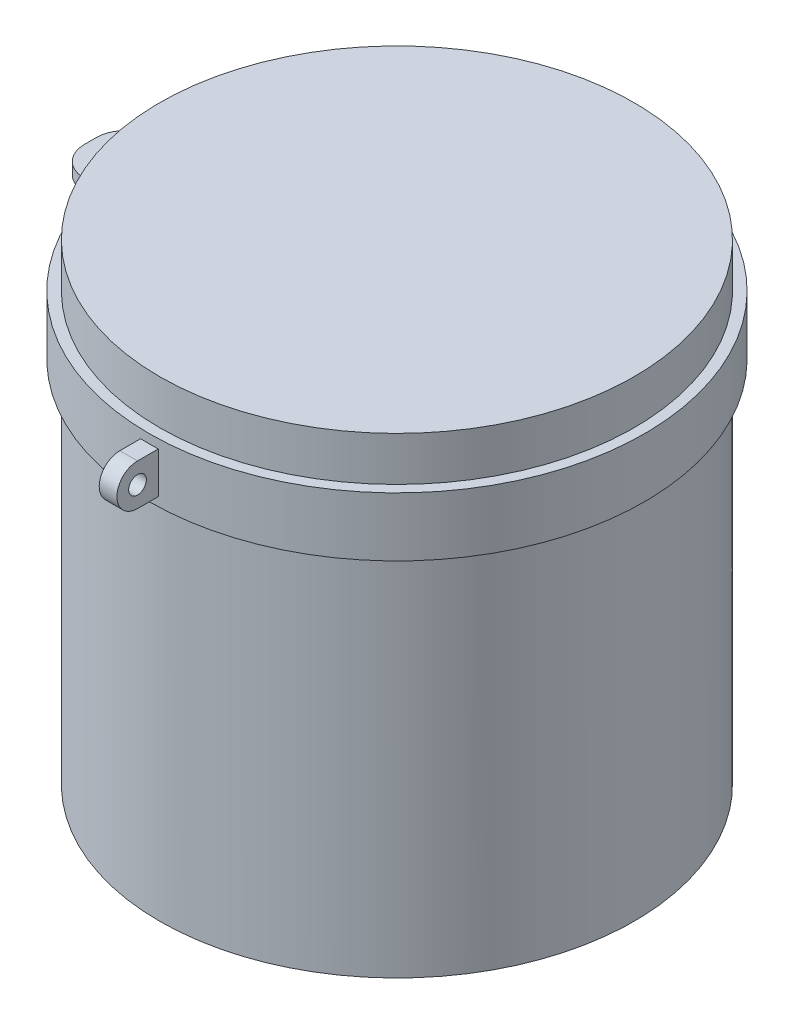
ISO-10303-21;
HEADER;
FILE_DESCRIPTION(('STEP AP214'),'2;1');
FILE_NAME('part.step','',(''),(''),'','','');
FILE_SCHEMA(('AUTOMOTIVE_DESIGN { 1 0 10303 214 1 1 1 1 }'));
ENDSEC;
DATA;
#1=APPLICATION_CONTEXT('core data for automotive mechanical design processes');
#2=APPLICATION_PROTOCOL_DEFINITION('international standard','automotive_design',2000,#1);
#3=PRODUCT_CONTEXT('',#1,'mechanical');
#4=PRODUCT('Part','Part','',(#3));
#5=PRODUCT_RELATED_PRODUCT_CATEGORY('part','',(#4));
#6=PRODUCT_DEFINITION_FORMATION('','',#4);
#7=PRODUCT_DEFINITION_CONTEXT('part definition',#1,'design');
#8=PRODUCT_DEFINITION('design','',#6,#7);
#9=PRODUCT_DEFINITION_SHAPE('','',#8);
#10=(LENGTH_UNIT() NAMED_UNIT(*) SI_UNIT(.MILLI.,.METRE.));
#11=(NAMED_UNIT(*) PLANE_ANGLE_UNIT() SI_UNIT($,.RADIAN.));
#12=(NAMED_UNIT(*) SI_UNIT($,.STERADIAN.) SOLID_ANGLE_UNIT());
#13=UNCERTAINTY_MEASURE_WITH_UNIT(LENGTH_MEASURE(1.E-05),#10,'distance_accuracy_value','');
#14=(GEOMETRIC_REPRESENTATION_CONTEXT(3) GLOBAL_UNCERTAINTY_ASSIGNED_CONTEXT((#13)) GLOBAL_UNIT_ASSIGNED_CONTEXT((#10,
#11,#12)) REPRESENTATION_CONTEXT('',''));
#15=CARTESIAN_POINT('',(0.,0.,0.));
#16=DIRECTION('',(0.,0.,1.));
#17=DIRECTION('',(1.,0.,0.));
#18=AXIS2_PLACEMENT_3D('',#15,#16,#17);
#19=CARTESIAN_POINT('',(0.,1662.87303259067,0.));
#20=DIRECTION('',(0.,1.,0.));
#21=DIRECTION('',(0.,0.,1.));
#22=AXIS2_PLACEMENT_3D('',#19,#20,#21);
#23=CYLINDRICAL_SURFACE('',#22,840.);
#24=CARTESIAN_POINT('',(0.,1250.,0.));
#25=DIRECTION('',(0.,1.,0.));
#26=DIRECTION('',(0.,0.,1.));
#27=AXIS2_PLACEMENT_3D('',#24,#25,#26);
#28=CIRCLE('',#27,840.);
#29=CARTESIAN_POINT('',(0.,1250.,840.));
#30=VERTEX_POINT('',#29);
#31=EDGE_CURVE('E307',#30,#30,#28,.T.);
#32=ORIENTED_EDGE('',*,*,#31,.T.);
#33=EDGE_LOOP('',(#32));
#34=FACE_BOUND('',#33,.T.);
#35=CARTESIAN_POINT('',(0.,1450.,0.));
#36=DIRECTION('',(0.,1.,0.));
#37=DIRECTION('',(0.,0.,1.));
#38=AXIS2_PLACEMENT_3D('',#35,#36,#37);
#39=CIRCLE('',#38,840.);
#40=CARTESIAN_POINT('',(0.,1450.,840.));
#41=VERTEX_POINT('',#40);
#42=EDGE_CURVE('E304',#41,#41,#39,.T.);
#43=ORIENTED_EDGE('',*,*,#42,.F.);
#44=EDGE_LOOP('',(#43));
#45=FACE_BOUND('',#44,.T.);
#46=DIRECTION('',(0.,1.,0.));
#47=VECTOR('',#46,1.);
#48=CARTESIAN_POINT('',(-30.,1662.87303259067,839.464114777993));
#49=LINE('',#48,#47);
#50=CARTESIAN_POINT('',(-30.,1280.,839.464114777993));
#51=VERTEX_POINT('',#50);
#52=CARTESIAN_POINT('',(-30.,1420.,839.464114777993));
#53=VERTEX_POINT('',#52);
#54=EDGE_CURVE('E313',#51,#53,#49,.T.);
#55=ORIENTED_EDGE('',*,*,#54,.T.);
#56=CARTESIAN_POINT('',(0.,1420.,0.));
#57=DIRECTION('',(0.,-1.,0.));
#58=DIRECTION('',(0.,0.,-1.));
#59=AXIS2_PLACEMENT_3D('',#56,#57,#58);
#60=CIRCLE('',#59,840.);
#61=CARTESIAN_POINT('',(30.,1420.,839.464114777993));
#62=VERTEX_POINT('',#61);
#63=EDGE_CURVE('E317',#53,#62,#60,.F.);
#64=ORIENTED_EDGE('',*,*,#63,.T.);
#65=DIRECTION('',(0.,1.,0.));
#66=VECTOR('',#65,1.);
#67=CARTESIAN_POINT('',(30.,1662.87303259067,839.464114777993));
#68=LINE('',#67,#66);
#69=CARTESIAN_POINT('',(30.,1280.,839.464114777993));
#70=VERTEX_POINT('',#69);
#71=EDGE_CURVE('E316',#70,#62,#68,.T.);
#72=ORIENTED_EDGE('',*,*,#71,.F.);
#73=CARTESIAN_POINT('',(0.,1280.,0.));
#74=DIRECTION('',(0.,1.,0.));
#75=DIRECTION('',(0.,0.,1.));
#76=AXIS2_PLACEMENT_3D('',#73,#74,#75);
#77=CIRCLE('',#76,840.);
#78=EDGE_CURVE('E310',#70,#51,#77,.F.);
#79=ORIENTED_EDGE('',*,*,#78,.T.);
#80=EDGE_LOOP('',(#55,#64,#72,#79));
#81=FACE_BOUND('',#80,.T.);
#82=CARTESIAN_POINT('',(0.,1330.,0.));
#83=DIRECTION('',(0.,-1.,0.));
#84=DIRECTION('',(0.,0.,1.));
#85=AXIS2_PLACEMENT_3D('',#82,#83,#84);
#86=CIRCLE('',#85,840.);
#87=CARTESIAN_POINT('',(-831.384387633061,1330.,120.));
#88=VERTEX_POINT('',#87);
#89=CARTESIAN_POINT('',(-831.384387633061,1330.,-120.));
#90=VERTEX_POINT('',#89);
#91=EDGE_CURVE('E55',#88,#90,#86,.T.);
#92=ORIENTED_EDGE('',*,*,#91,.T.);
#93=DIRECTION('',(0.,-1.,0.));
#94=VECTOR('',#93,1.);
#95=CARTESIAN_POINT('',(-831.384387633061,1370.,-120.));
#96=LINE('',#95,#94);
#97=CARTESIAN_POINT('',(-831.384387633061,1370.,-120.));
#98=VERTEX_POINT('',#97);
#99=EDGE_CURVE('E278',#98,#90,#96,.T.);
#100=ORIENTED_EDGE('',*,*,#99,.F.);
#101=CARTESIAN_POINT('',(0.,1370.,0.));
#102=DIRECTION('',(0.,-1.,0.));
#103=DIRECTION('',(0.,0.,1.));
#104=AXIS2_PLACEMENT_3D('',#101,#102,#103);
#105=CIRCLE('',#104,840.);
#106=CARTESIAN_POINT('',(-831.384387633061,1370.,120.));
#107=VERTEX_POINT('',#106);
#108=EDGE_CURVE('E239',#107,#98,#105,.T.);
#109=ORIENTED_EDGE('',*,*,#108,.F.);
#110=DIRECTION('',(0.,-1.,0.));
#111=VECTOR('',#110,1.);
#112=CARTESIAN_POINT('',(-831.384387633061,1370.,120.));
#113=LINE('',#112,#111);
#114=EDGE_CURVE('E253',#107,#88,#113,.T.);
#115=ORIENTED_EDGE('',*,*,#114,.T.);
#116=EDGE_LOOP('',(#92,#100,#109,#115));
#117=FACE_BOUND('',#116,.T.);
#118=ADVANCED_FACE('F39',(#34,#45,#81,#117),#23,.T.);
#119=CARTESIAN_POINT('',(-800.,1250.,0.));
#120=DIRECTION('',(0.,-1.,0.));
#121=DIRECTION('',(0.,0.,-1.));
#122=AXIS2_PLACEMENT_3D('',#119,#120,#121);
#123=PLANE('',#122);
#124=CARTESIAN_POINT('',(0.,1250.,0.));
#125=DIRECTION('',(0.,-1.,0.));
#126=DIRECTION('',(0.,0.,-1.));
#127=AXIS2_PLACEMENT_3D('',#124,#125,#126);
#128=CIRCLE('',#127,805.);
#129=CARTESIAN_POINT('',(0.,1250.,-805.));
#130=VERTEX_POINT('',#129);
#131=EDGE_CURVE('E12',#130,#130,#128,.T.);
#132=ORIENTED_EDGE('',*,*,#131,.F.);
#133=EDGE_LOOP('',(#132));
#134=FACE_BOUND('',#133,.T.);
#135=ORIENTED_EDGE('',*,*,#31,.F.);
#136=EDGE_LOOP('',(#135));
#137=FACE_BOUND('',#136,.T.);
#138=ADVANCED_FACE('F41',(#134,#137),#123,.T.);
#139=CARTESIAN_POINT('',(-800.,1450.,0.));
#140=DIRECTION('',(0.,1.,0.));
#141=DIRECTION('',(0.,0.,1.));
#142=AXIS2_PLACEMENT_3D('',#139,#140,#141);
#143=PLANE('',#142);
#144=CARTESIAN_POINT('',(0.,1450.,0.));
#145=DIRECTION('',(0.,1.,0.));
#146=DIRECTION('',(0.,0.,1.));
#147=AXIS2_PLACEMENT_3D('',#144,#145,#146);
#148=CIRCLE('',#147,805.);
#149=CARTESIAN_POINT('',(0.,1450.,805.));
#150=VERTEX_POINT('',#149);
#151=EDGE_CURVE('E43',#150,#150,#148,.T.);
#152=ORIENTED_EDGE('',*,*,#151,.F.);
#153=EDGE_LOOP('',(#152));
#154=FACE_BOUND('',#153,.T.);
#155=ORIENTED_EDGE('',*,*,#42,.T.);
#156=EDGE_LOOP('',(#155));
#157=FACE_BOUND('',#156,.T.);
#158=ADVANCED_FACE('F327',(#154,#157),#143,.T.);
#159=CARTESIAN_POINT('',(30.,1350.,910.));
#160=DIRECTION('',(1.,0.,0.));
#161=DIRECTION('',(0.,0.,-1.));
#162=AXIS2_PLACEMENT_3D('',#159,#160,#161);
#163=PLANE('',#162);
#164=DIRECTION('',(0.,0.,-1.));
#165=VECTOR('',#164,1.);
#166=CARTESIAN_POINT('',(30.,1280.,800.));
#167=LINE('',#166,#165);
#168=CARTESIAN_POINT('',(30.,1280.,910.));
#169=VERTEX_POINT('',#168);
#170=EDGE_CURVE('E292',#169,#70,#167,.T.);
#171=ORIENTED_EDGE('',*,*,#170,.T.);
#172=ORIENTED_EDGE('',*,*,#71,.T.);
#173=DIRECTION('',(0.,0.,1.));
#174=VECTOR('',#173,1.);
#175=CARTESIAN_POINT('',(30.,1420.,910.));
#176=LINE('',#175,#174);
#177=CARTESIAN_POINT('',(30.,1420.,910.));
#178=VERTEX_POINT('',#177);
#179=EDGE_CURVE('E288',#62,#178,#176,.T.);
#180=ORIENTED_EDGE('',*,*,#179,.T.);
#181=CARTESIAN_POINT('',(30.,1350.,910.));
#182=DIRECTION('',(1.,0.,0.));
#183=DIRECTION('',(0.,0.,-1.));
#184=AXIS2_PLACEMENT_3D('',#181,#182,#183);
#185=CIRCLE('',#184,70.0000000000001);
#186=EDGE_CURVE('E290',#178,#169,#185,.T.);
#187=ORIENTED_EDGE('',*,*,#186,.T.);
#188=EDGE_LOOP('',(#171,#172,#180,#187));
#189=FACE_BOUND('',#188,.T.);
#190=CARTESIAN_POINT('',(30.,1350.,910.));
#191=DIRECTION('',(1.,0.,0.));
#192=DIRECTION('',(0.,0.,1.));
#193=AXIS2_PLACEMENT_3D('',#190,#191,#192);
#194=CIRCLE('',#193,30.0000000000001);
#195=CARTESIAN_POINT('',(30.,1350.,940.));
#196=VERTEX_POINT('',#195);
#197=EDGE_CURVE('E282',#196,#196,#194,.T.);
#198=ORIENTED_EDGE('',*,*,#197,.F.);
#199=EDGE_LOOP('',(#198));
#200=FACE_BOUND('',#199,.T.);
#201=ADVANCED_FACE('F330',(#189,#200),#163,.T.);
#202=CARTESIAN_POINT('',(-30.,1350.,910.));
#203=DIRECTION('',(1.,0.,0.));
#204=DIRECTION('',(0.,0.,-1.));
#205=AXIS2_PLACEMENT_3D('',#202,#203,#204);
#206=PLANE('',#205);
#207=ORIENTED_EDGE('',*,*,#54,.F.);
#208=DIRECTION('',(0.,0.,-1.));
#209=VECTOR('',#208,1.);
#210=CARTESIAN_POINT('',(-30.,1280.,800.));
#211=LINE('',#210,#209);
#212=CARTESIAN_POINT('',(-30.,1280.,910.));
#213=VERTEX_POINT('',#212);
#214=EDGE_CURVE('E63',#213,#51,#211,.T.);
#215=ORIENTED_EDGE('',*,*,#214,.F.);
#216=CARTESIAN_POINT('',(-30.,1350.,910.));
#217=DIRECTION('',(1.,0.,0.));
#218=DIRECTION('',(0.,0.,-1.));
#219=AXIS2_PLACEMENT_3D('',#216,#217,#218);
#220=CIRCLE('',#219,70.0000000000001);
#221=CARTESIAN_POINT('',(-30.,1420.,910.));
#222=VERTEX_POINT('',#221);
#223=EDGE_CURVE('E297',#222,#213,#220,.T.);
#224=ORIENTED_EDGE('',*,*,#223,.F.);
#225=DIRECTION('',(0.,0.,1.));
#226=VECTOR('',#225,1.);
#227=CARTESIAN_POINT('',(-30.,1420.,910.));
#228=LINE('',#227,#226);
#229=EDGE_CURVE('E285',#53,#222,#228,.T.);
#230=ORIENTED_EDGE('',*,*,#229,.F.);
#231=EDGE_LOOP('',(#207,#215,#224,#230));
#232=FACE_BOUND('',#231,.T.);
#233=CARTESIAN_POINT('',(-30.,1350.,910.));
#234=DIRECTION('',(1.,0.,0.));
#235=DIRECTION('',(0.,0.,1.));
#236=AXIS2_PLACEMENT_3D('',#233,#234,#235);
#237=CIRCLE('',#236,30.0000000000001);
#238=CARTESIAN_POINT('',(-30.,1350.,940.));
#239=VERTEX_POINT('',#238);
#240=EDGE_CURVE('E281',#239,#239,#237,.T.);
#241=ORIENTED_EDGE('',*,*,#240,.T.);
#242=EDGE_LOOP('',(#241));
#243=FACE_BOUND('',#242,.T.);
#244=ADVANCED_FACE('F390',(#232,#243),#206,.F.);
#245=CARTESIAN_POINT('',(30.,1420.,910.));
#246=DIRECTION('',(0.,-1.,0.));
#247=DIRECTION('',(0.,0.,-1.));
#248=AXIS2_PLACEMENT_3D('',#245,#246,#247);
#249=PLANE('',#248);
#250=ORIENTED_EDGE('',*,*,#63,.F.);
#251=ORIENTED_EDGE('',*,*,#229,.T.);
#252=DIRECTION('',(-1.,0.,0.));
#253=VECTOR('',#252,1.);
#254=CARTESIAN_POINT('',(30.,1420.,910.));
#255=LINE('',#254,#253);
#256=EDGE_CURVE('E301',#178,#222,#255,.T.);
#257=ORIENTED_EDGE('',*,*,#256,.F.);
#258=ORIENTED_EDGE('',*,*,#179,.F.);
#259=EDGE_LOOP('',(#250,#251,#257,#258));
#260=FACE_BOUND('',#259,.T.);
#261=ADVANCED_FACE('F394',(#260),#249,.F.);
#262=CARTESIAN_POINT('',(30.,1350.,910.));
#263=DIRECTION('',(-1.,0.,0.));
#264=DIRECTION('',(0.,0.,1.));
#265=AXIS2_PLACEMENT_3D('',#262,#263,#264);
#266=CYLINDRICAL_SURFACE('',#265,70.0000000000001);
#267=ORIENTED_EDGE('',*,*,#223,.T.);
#268=DIRECTION('',(-1.,0.,0.));
#269=VECTOR('',#268,1.);
#270=CARTESIAN_POINT('',(30.,1280.,910.));
#271=LINE('',#270,#269);
#272=EDGE_CURVE('E295',#169,#213,#271,.T.);
#273=ORIENTED_EDGE('',*,*,#272,.F.);
#274=ORIENTED_EDGE('',*,*,#186,.F.);
#275=ORIENTED_EDGE('',*,*,#256,.T.);
#276=EDGE_LOOP('',(#267,#273,#274,#275));
#277=FACE_BOUND('',#276,.T.);
#278=ADVANCED_FACE('F398',(#277),#266,.T.);
#279=CARTESIAN_POINT('',(30.,1280.,800.));
#280=DIRECTION('',(0.,1.,0.));
#281=DIRECTION('',(0.,0.,1.));
#282=AXIS2_PLACEMENT_3D('',#279,#280,#281);
#283=PLANE('',#282);
#284=ORIENTED_EDGE('',*,*,#78,.F.);
#285=ORIENTED_EDGE('',*,*,#170,.F.);
#286=ORIENTED_EDGE('',*,*,#272,.T.);
#287=ORIENTED_EDGE('',*,*,#214,.T.);
#288=EDGE_LOOP('',(#284,#285,#286,#287));
#289=FACE_BOUND('',#288,.T.);
#290=ADVANCED_FACE('F372',(#289),#283,.F.);
#291=CARTESIAN_POINT('',(30.,1350.,910.));
#292=DIRECTION('',(-1.,0.,0.));
#293=DIRECTION('',(0.,0.,1.));
#294=AXIS2_PLACEMENT_3D('',#291,#292,#293);
#295=CYLINDRICAL_SURFACE('',#294,30.0000000000001);
#296=ORIENTED_EDGE('',*,*,#197,.T.);
#297=EDGE_LOOP('',(#296));
#298=FACE_BOUND('',#297,.T.);
#299=ORIENTED_EDGE('',*,*,#240,.F.);
#300=EDGE_LOOP('',(#299));
#301=FACE_BOUND('',#300,.T.);
#302=ADVANCED_FACE('F365',(#298,#301),#295,.F.);
#303=CARTESIAN_POINT('',(0.,1370.,0.));
#304=DIRECTION('',(0.,1.,0.));
#305=DIRECTION('',(0.,0.,1.));
#306=AXIS2_PLACEMENT_3D('',#303,#304,#305);
#307=PLANE('',#306);
#308=ORIENTED_EDGE('',*,*,#108,.T.);
#309=DIRECTION('',(-1.,0.,0.));
#310=VECTOR('',#309,1.);
#311=CARTESIAN_POINT('',(-831.384387633061,1370.,-120.));
#312=LINE('',#311,#310);
#313=CARTESIAN_POINT('',(-940.,1370.,-120.));
#314=VERTEX_POINT('',#313);
#315=EDGE_CURVE('E242',#98,#314,#312,.T.);
#316=ORIENTED_EDGE('',*,*,#315,.T.);
#317=CARTESIAN_POINT('',(-940.,1370.,-20.));
#318=DIRECTION('',(0.,1.,0.));
#319=DIRECTION('',(0.,0.,-1.));
#320=AXIS2_PLACEMENT_3D('',#317,#318,#319);
#321=CIRCLE('',#320,99.9999999999999);
#322=CARTESIAN_POINT('',(-1040.,1370.,-19.9999999999999));
#323=VERTEX_POINT('',#322);
#324=EDGE_CURVE('E245',#314,#323,#321,.T.);
#325=ORIENTED_EDGE('',*,*,#324,.T.);
#326=DIRECTION('',(0.,0.,1.));
#327=VECTOR('',#326,1.);
#328=CARTESIAN_POINT('',(-1040.,1370.,-20.));
#329=LINE('',#328,#327);
#330=CARTESIAN_POINT('',(-1040.,1370.,20.));
#331=VERTEX_POINT('',#330);
#332=EDGE_CURVE('E247',#323,#331,#329,.T.);
#333=ORIENTED_EDGE('',*,*,#332,.T.);
#334=CARTESIAN_POINT('',(-940.,1370.,20.));
#335=DIRECTION('',(0.,1.,0.));
#336=DIRECTION('',(0.,0.,1.));
#337=AXIS2_PLACEMENT_3D('',#334,#335,#336);
#338=CIRCLE('',#337,99.9999999999999);
#339=CARTESIAN_POINT('',(-940.,1370.,120.));
#340=VERTEX_POINT('',#339);
#341=EDGE_CURVE('E249',#331,#340,#338,.T.);
#342=ORIENTED_EDGE('',*,*,#341,.T.);
#343=DIRECTION('',(1.,0.,0.));
#344=VECTOR('',#343,1.);
#345=CARTESIAN_POINT('',(-831.384387633061,1370.,120.));
#346=LINE('',#345,#344);
#347=EDGE_CURVE('E251',#340,#107,#346,.T.);
#348=ORIENTED_EDGE('',*,*,#347,.T.);
#349=EDGE_LOOP('',(#308,#316,#325,#333,#342,#348));
#350=FACE_BOUND('',#349,.T.);
#351=DIRECTION('',(-1.,0.,0.));
#352=VECTOR('',#351,1.);
#353=CARTESIAN_POINT('',(-935.,1370.,-65.));
#354=LINE('',#353,#352);
#355=CARTESIAN_POINT('',(-935.,1370.,-65.));
#356=VERTEX_POINT('',#355);
#357=CARTESIAN_POINT('',(-945.,1370.,-65.));
#358=VERTEX_POINT('',#357);
#359=EDGE_CURVE('E178',#356,#358,#354,.T.);
#360=ORIENTED_EDGE('',*,*,#359,.F.);
#361=CARTESIAN_POINT('',(-935.,1370.,-25.));
#362=DIRECTION('',(0.,1.,0.));
#363=DIRECTION('',(0.,0.,1.));
#364=AXIS2_PLACEMENT_3D('',#361,#362,#363);
#365=CIRCLE('',#364,40.);
#366=CARTESIAN_POINT('',(-895.,1370.,-24.9999999999997));
#367=VERTEX_POINT('',#366);
#368=EDGE_CURVE('E168',#367,#356,#365,.T.);
#369=ORIENTED_EDGE('',*,*,#368,.F.);
#370=DIRECTION('',(0.,0.,-1.));
#371=VECTOR('',#370,1.);
#372=CARTESIAN_POINT('',(-895.,1370.,24.9999999999997));
#373=LINE('',#372,#371);
#374=CARTESIAN_POINT('',(-895.,1370.,24.9999999999997));
#375=VERTEX_POINT('',#374);
#376=EDGE_CURVE('E204',#375,#367,#373,.T.);
#377=ORIENTED_EDGE('',*,*,#376,.F.);
#378=CARTESIAN_POINT('',(-935.,1370.,25.));
#379=DIRECTION('',(0.,1.,0.));
#380=DIRECTION('',(0.,0.,-1.));
#381=AXIS2_PLACEMENT_3D('',#378,#379,#380);
#382=CIRCLE('',#381,40.);
#383=CARTESIAN_POINT('',(-935.,1370.,65.));
#384=VERTEX_POINT('',#383);
#385=EDGE_CURVE('E201',#384,#375,#382,.T.);
#386=ORIENTED_EDGE('',*,*,#385,.F.);
#387=DIRECTION('',(1.,0.,0.));
#388=VECTOR('',#387,1.);
#389=CARTESIAN_POINT('',(-935.,1370.,65.));
#390=LINE('',#389,#388);
#391=CARTESIAN_POINT('',(-945.,1370.,65.));
#392=VERTEX_POINT('',#391);
#393=EDGE_CURVE('E199',#392,#384,#390,.T.);
#394=ORIENTED_EDGE('',*,*,#393,.F.);
#395=CARTESIAN_POINT('',(-945.,1370.,25.));
#396=DIRECTION('',(0.,1.,0.));
#397=DIRECTION('',(0.,0.,1.));
#398=AXIS2_PLACEMENT_3D('',#395,#396,#397);
#399=CIRCLE('',#398,40.);
#400=CARTESIAN_POINT('',(-985.,1370.,24.9999999999997));
#401=VERTEX_POINT('',#400);
#402=EDGE_CURVE('E197',#401,#392,#399,.T.);
#403=ORIENTED_EDGE('',*,*,#402,.F.);
#404=DIRECTION('',(0.,0.,1.));
#405=VECTOR('',#404,1.);
#406=CARTESIAN_POINT('',(-985.,1370.,24.9999999999997));
#407=LINE('',#406,#405);
#408=CARTESIAN_POINT('',(-985.,1370.,-24.9999999999997));
#409=VERTEX_POINT('',#408);
#410=EDGE_CURVE('E193',#409,#401,#407,.T.);
#411=ORIENTED_EDGE('',*,*,#410,.F.);
#412=CARTESIAN_POINT('',(-945.,1370.,-25.));
#413=DIRECTION('',(0.,1.,0.));
#414=DIRECTION('',(0.,0.,-1.));
#415=AXIS2_PLACEMENT_3D('',#412,#413,#414);
#416=CIRCLE('',#415,40.);
#417=EDGE_CURVE('E191',#358,#409,#416,.T.);
#418=ORIENTED_EDGE('',*,*,#417,.F.);
#419=EDGE_LOOP('',(#360,#369,#377,#386,#394,#403,#411,#418));
#420=FACE_BOUND('',#419,.T.);
#421=ADVANCED_FACE('F189',(#350,#420),#307,.T.);
#422=CARTESIAN_POINT('',(0.,1330.,0.));
#423=DIRECTION('',(0.,1.,0.));
#424=DIRECTION('',(0.,0.,1.));
#425=AXIS2_PLACEMENT_3D('',#422,#423,#424);
#426=PLANE('',#425);
#427=ORIENTED_EDGE('',*,*,#91,.F.);
#428=DIRECTION('',(1.,0.,0.));
#429=VECTOR('',#428,1.);
#430=CARTESIAN_POINT('',(-831.384387633061,1330.,120.));
#431=LINE('',#430,#429);
#432=CARTESIAN_POINT('',(-940.,1330.,120.));
#433=VERTEX_POINT('',#432);
#434=EDGE_CURVE('E243',#433,#88,#431,.T.);
#435=ORIENTED_EDGE('',*,*,#434,.F.);
#436=CARTESIAN_POINT('',(-940.,1330.,20.));
#437=DIRECTION('',(0.,1.,0.));
#438=DIRECTION('',(0.,0.,1.));
#439=AXIS2_PLACEMENT_3D('',#436,#437,#438);
#440=CIRCLE('',#439,99.9999999999999);
#441=CARTESIAN_POINT('',(-1040.,1330.,20.));
#442=VERTEX_POINT('',#441);
#443=EDGE_CURVE('E261',#442,#433,#440,.T.);
#444=ORIENTED_EDGE('',*,*,#443,.F.);
#445=DIRECTION('',(0.,0.,1.));
#446=VECTOR('',#445,1.);
#447=CARTESIAN_POINT('',(-1040.,1330.,-20.));
#448=LINE('',#447,#446);
#449=CARTESIAN_POINT('',(-1040.,1330.,-19.9999999999999));
#450=VERTEX_POINT('',#449);
#451=EDGE_CURVE('E259',#450,#442,#448,.T.);
#452=ORIENTED_EDGE('',*,*,#451,.F.);
#453=CARTESIAN_POINT('',(-940.,1330.,-20.));
#454=DIRECTION('',(0.,1.,0.));
#455=DIRECTION('',(0.,0.,-1.));
#456=AXIS2_PLACEMENT_3D('',#453,#454,#455);
#457=CIRCLE('',#456,99.9999999999999);
#458=CARTESIAN_POINT('',(-940.,1330.,-120.));
#459=VERTEX_POINT('',#458);
#460=EDGE_CURVE('E257',#459,#450,#457,.T.);
#461=ORIENTED_EDGE('',*,*,#460,.F.);
#462=DIRECTION('',(-1.,0.,0.));
#463=VECTOR('',#462,1.);
#464=CARTESIAN_POINT('',(-831.384387633061,1330.,-120.));
#465=LINE('',#464,#463);
#466=EDGE_CURVE('E255',#90,#459,#465,.T.);
#467=ORIENTED_EDGE('',*,*,#466,.F.);
#468=EDGE_LOOP('',(#427,#435,#444,#452,#461,#467));
#469=FACE_BOUND('',#468,.T.);
#470=CARTESIAN_POINT('',(-935.,1330.,-25.));
#471=DIRECTION('',(0.,1.,0.));
#472=DIRECTION('',(0.,0.,1.));
#473=AXIS2_PLACEMENT_3D('',#470,#471,#472);
#474=CIRCLE('',#473,40.);
#475=CARTESIAN_POINT('',(-895.,1330.,-24.9999999999997));
#476=VERTEX_POINT('',#475);
#477=CARTESIAN_POINT('',(-935.,1330.,-65.));
#478=VERTEX_POINT('',#477);
#479=EDGE_CURVE('E206',#476,#478,#474,.T.);
#480=ORIENTED_EDGE('',*,*,#479,.T.);
#481=DIRECTION('',(-1.,0.,0.));
#482=VECTOR('',#481,1.);
#483=CARTESIAN_POINT('',(-935.,1330.,-65.));
#484=LINE('',#483,#482);
#485=CARTESIAN_POINT('',(-945.,1330.,-65.));
#486=VERTEX_POINT('',#485);
#487=EDGE_CURVE('E185',#478,#486,#484,.T.);
#488=ORIENTED_EDGE('',*,*,#487,.T.);
#489=CARTESIAN_POINT('',(-945.,1330.,-25.));
#490=DIRECTION('',(0.,1.,0.));
#491=DIRECTION('',(0.,0.,-1.));
#492=AXIS2_PLACEMENT_3D('',#489,#490,#491);
#493=CIRCLE('',#492,40.);
#494=CARTESIAN_POINT('',(-985.,1330.,-24.9999999999997));
#495=VERTEX_POINT('',#494);
#496=EDGE_CURVE('E210',#486,#495,#493,.T.);
#497=ORIENTED_EDGE('',*,*,#496,.T.);
#498=DIRECTION('',(0.,0.,1.));
#499=VECTOR('',#498,1.);
#500=CARTESIAN_POINT('',(-985.,1330.,24.9999999999997));
#501=LINE('',#500,#499);
#502=CARTESIAN_POINT('',(-985.,1330.,24.9999999999997));
#503=VERTEX_POINT('',#502);
#504=EDGE_CURVE('E213',#495,#503,#501,.T.);
#505=ORIENTED_EDGE('',*,*,#504,.T.);
#506=CARTESIAN_POINT('',(-945.,1330.,25.));
#507=DIRECTION('',(0.,1.,0.));
#508=DIRECTION('',(0.,0.,1.));
#509=AXIS2_PLACEMENT_3D('',#506,#507,#508);
#510=CIRCLE('',#509,40.);
#511=CARTESIAN_POINT('',(-945.,1330.,65.));
#512=VERTEX_POINT('',#511);
#513=EDGE_CURVE('E216',#503,#512,#510,.T.);
#514=ORIENTED_EDGE('',*,*,#513,.T.);
#515=DIRECTION('',(1.,0.,0.));
#516=VECTOR('',#515,1.);
#517=CARTESIAN_POINT('',(-935.,1330.,65.));
#518=LINE('',#517,#516);
#519=CARTESIAN_POINT('',(-935.,1330.,65.));
#520=VERTEX_POINT('',#519);
#521=EDGE_CURVE('E219',#512,#520,#518,.T.);
#522=ORIENTED_EDGE('',*,*,#521,.T.);
#523=CARTESIAN_POINT('',(-935.,1330.,25.));
#524=DIRECTION('',(0.,1.,0.));
#525=DIRECTION('',(0.,0.,-1.));
#526=AXIS2_PLACEMENT_3D('',#523,#524,#525);
#527=CIRCLE('',#526,40.);
#528=CARTESIAN_POINT('',(-895.,1330.,24.9999999999997));
#529=VERTEX_POINT('',#528);
#530=EDGE_CURVE('E222',#520,#529,#527,.T.);
#531=ORIENTED_EDGE('',*,*,#530,.T.);
#532=DIRECTION('',(0.,0.,-1.));
#533=VECTOR('',#532,1.);
#534=CARTESIAN_POINT('',(-895.,1330.,24.9999999999997));
#535=LINE('',#534,#533);
#536=EDGE_CURVE('E179',#529,#476,#535,.T.);
#537=ORIENTED_EDGE('',*,*,#536,.T.);
#538=EDGE_LOOP('',(#480,#488,#497,#505,#514,#522,#531,#537));
#539=FACE_BOUND('',#538,.T.);
#540=ADVANCED_FACE('F345',(#469,#539),#426,.F.);
#541=CARTESIAN_POINT('',(-831.384387633061,1370.,-120.));
#542=DIRECTION('',(0.,0.,1.));
#543=DIRECTION('',(1.,0.,0.));
#544=AXIS2_PLACEMENT_3D('',#541,#542,#543);
#545=PLANE('',#544);
#546=ORIENTED_EDGE('',*,*,#466,.T.);
#547=DIRECTION('',(0.,-1.,0.));
#548=VECTOR('',#547,1.);
#549=CARTESIAN_POINT('',(-940.,1370.,-120.));
#550=LINE('',#549,#548);
#551=EDGE_CURVE('E275',#314,#459,#550,.T.);
#552=ORIENTED_EDGE('',*,*,#551,.F.);
#553=ORIENTED_EDGE('',*,*,#315,.F.);
#554=ORIENTED_EDGE('',*,*,#99,.T.);
#555=EDGE_LOOP('',(#546,#552,#553,#554));
#556=FACE_BOUND('',#555,.T.);
#557=ADVANCED_FACE('F362',(#556),#545,.F.);
#558=CARTESIAN_POINT('',(-940.,1370.,-20.));
#559=DIRECTION('',(0.,-1.,0.));
#560=DIRECTION('',(0.,0.,-1.));
#561=AXIS2_PLACEMENT_3D('',#558,#559,#560);
#562=CYLINDRICAL_SURFACE('',#561,99.9999999999999);
#563=ORIENTED_EDGE('',*,*,#460,.T.);
#564=DIRECTION('',(0.,-1.,0.));
#565=VECTOR('',#564,1.);
#566=CARTESIAN_POINT('',(-1040.,1370.,-19.9999999999999));
#567=LINE('',#566,#565);
#568=EDGE_CURVE('E272',#323,#450,#567,.T.);
#569=ORIENTED_EDGE('',*,*,#568,.F.);
#570=ORIENTED_EDGE('',*,*,#324,.F.);
#571=ORIENTED_EDGE('',*,*,#551,.T.);
#572=EDGE_LOOP('',(#563,#569,#570,#571));
#573=FACE_BOUND('',#572,.T.);
#574=ADVANCED_FACE('F359',(#573),#562,.T.);
#575=CARTESIAN_POINT('',(-1040.,1370.,-20.));
#576=DIRECTION('',(1.,0.,0.));
#577=DIRECTION('',(0.,0.,-1.));
#578=AXIS2_PLACEMENT_3D('',#575,#576,#577);
#579=PLANE('',#578);
#580=ORIENTED_EDGE('',*,*,#451,.T.);
#581=DIRECTION('',(0.,-1.,0.));
#582=VECTOR('',#581,1.);
#583=CARTESIAN_POINT('',(-1040.,1370.,20.));
#584=LINE('',#583,#582);
#585=EDGE_CURVE('E269',#331,#442,#584,.T.);
#586=ORIENTED_EDGE('',*,*,#585,.F.);
#587=ORIENTED_EDGE('',*,*,#332,.F.);
#588=ORIENTED_EDGE('',*,*,#568,.T.);
#589=EDGE_LOOP('',(#580,#586,#587,#588));
#590=FACE_BOUND('',#589,.T.);
#591=ADVANCED_FACE('F355',(#590),#579,.F.);
#592=CARTESIAN_POINT('',(-940.,1370.,20.));
#593=DIRECTION('',(0.,-1.,0.));
#594=DIRECTION('',(0.,0.,-1.));
#595=AXIS2_PLACEMENT_3D('',#592,#593,#594);
#596=CYLINDRICAL_SURFACE('',#595,99.9999999999999);
#597=ORIENTED_EDGE('',*,*,#443,.T.);
#598=DIRECTION('',(0.,-1.,0.));
#599=VECTOR('',#598,1.);
#600=CARTESIAN_POINT('',(-940.,1370.,120.));
#601=LINE('',#600,#599);
#602=EDGE_CURVE('E266',#340,#433,#601,.T.);
#603=ORIENTED_EDGE('',*,*,#602,.F.);
#604=ORIENTED_EDGE('',*,*,#341,.F.);
#605=ORIENTED_EDGE('',*,*,#585,.T.);
#606=EDGE_LOOP('',(#597,#603,#604,#605));
#607=FACE_BOUND('',#606,.T.);
#608=ADVANCED_FACE('F350',(#607),#596,.T.);
#609=CARTESIAN_POINT('',(-831.384387633061,1370.,120.));
#610=DIRECTION('',(0.,0.,-1.));
#611=DIRECTION('',(-1.,0.,0.));
#612=AXIS2_PLACEMENT_3D('',#609,#610,#611);
#613=PLANE('',#612);
#614=ORIENTED_EDGE('',*,*,#434,.T.);
#615=ORIENTED_EDGE('',*,*,#114,.F.);
#616=ORIENTED_EDGE('',*,*,#347,.F.);
#617=ORIENTED_EDGE('',*,*,#602,.T.);
#618=EDGE_LOOP('',(#614,#615,#616,#617));
#619=FACE_BOUND('',#618,.T.);
#620=ADVANCED_FACE('F342',(#619),#613,.F.);
#621=CARTESIAN_POINT('',(-935.,1370.,-25.));
#622=DIRECTION('',(0.,-1.,0.));
#623=DIRECTION('',(0.,0.,-1.));
#624=AXIS2_PLACEMENT_3D('',#621,#622,#623);
#625=CYLINDRICAL_SURFACE('',#624,40.);
#626=ORIENTED_EDGE('',*,*,#479,.F.);
#627=DIRECTION('',(0.,-1.,0.));
#628=VECTOR('',#627,1.);
#629=CARTESIAN_POINT('',(-895.,1370.,-24.9999999999997));
#630=LINE('',#629,#628);
#631=EDGE_CURVE('E174',#367,#476,#630,.T.);
#632=ORIENTED_EDGE('',*,*,#631,.F.);
#633=ORIENTED_EDGE('',*,*,#368,.T.);
#634=DIRECTION('',(0.,-1.,0.));
#635=VECTOR('',#634,1.);
#636=CARTESIAN_POINT('',(-935.,1370.,-65.));
#637=LINE('',#636,#635);
#638=EDGE_CURVE('E171',#356,#478,#637,.T.);
#639=ORIENTED_EDGE('',*,*,#638,.T.);
#640=EDGE_LOOP('',(#626,#632,#633,#639));
#641=FACE_BOUND('',#640,.T.);
#642=ADVANCED_FACE('F170',(#641),#625,.F.);
#643=CARTESIAN_POINT('',(-935.,1370.,-65.));
#644=DIRECTION('',(0.,0.,1.));
#645=DIRECTION('',(1.,0.,0.));
#646=AXIS2_PLACEMENT_3D('',#643,#644,#645);
#647=PLANE('',#646);
#648=ORIENTED_EDGE('',*,*,#487,.F.);
#649=ORIENTED_EDGE('',*,*,#638,.F.);
#650=ORIENTED_EDGE('',*,*,#359,.T.);
#651=DIRECTION('',(0.,-1.,0.));
#652=VECTOR('',#651,1.);
#653=CARTESIAN_POINT('',(-945.,1370.,-65.));
#654=LINE('',#653,#652);
#655=EDGE_CURVE('E186',#358,#486,#654,.T.);
#656=ORIENTED_EDGE('',*,*,#655,.T.);
#657=EDGE_LOOP('',(#648,#649,#650,#656));
#658=FACE_BOUND('',#657,.T.);
#659=ADVANCED_FACE('F182',(#658),#647,.T.);
#660=CARTESIAN_POINT('',(-945.,1370.,-25.));
#661=DIRECTION('',(0.,-1.,0.));
#662=DIRECTION('',(0.,0.,-1.));
#663=AXIS2_PLACEMENT_3D('',#660,#661,#662);
#664=CYLINDRICAL_SURFACE('',#663,40.);
#665=ORIENTED_EDGE('',*,*,#496,.F.);
#666=ORIENTED_EDGE('',*,*,#655,.F.);
#667=ORIENTED_EDGE('',*,*,#417,.T.);
#668=DIRECTION('',(0.,-1.,0.));
#669=VECTOR('',#668,1.);
#670=CARTESIAN_POINT('',(-985.,1370.,-24.9999999999997));
#671=LINE('',#670,#669);
#672=EDGE_CURVE('E236',#409,#495,#671,.T.);
#673=ORIENTED_EDGE('',*,*,#672,.T.);
#674=EDGE_LOOP('',(#665,#666,#667,#673));
#675=FACE_BOUND('',#674,.T.);
#676=ADVANCED_FACE('F495',(#675),#664,.F.);
#677=CARTESIAN_POINT('',(-985.,1370.,24.9999999999997));
#678=DIRECTION('',(1.,0.,0.));
#679=DIRECTION('',(0.,0.,-1.));
#680=AXIS2_PLACEMENT_3D('',#677,#678,#679);
#681=PLANE('',#680);
#682=ORIENTED_EDGE('',*,*,#504,.F.);
#683=ORIENTED_EDGE('',*,*,#672,.F.);
#684=ORIENTED_EDGE('',*,*,#410,.T.);
#685=DIRECTION('',(0.,-1.,0.));
#686=VECTOR('',#685,1.);
#687=CARTESIAN_POINT('',(-985.,1370.,24.9999999999997));
#688=LINE('',#687,#686);
#689=EDGE_CURVE('E234',#401,#503,#688,.T.);
#690=ORIENTED_EDGE('',*,*,#689,.T.);
#691=EDGE_LOOP('',(#682,#683,#684,#690));
#692=FACE_BOUND('',#691,.T.);
#693=ADVANCED_FACE('F503',(#692),#681,.T.);
#694=CARTESIAN_POINT('',(-945.,1370.,25.));
#695=DIRECTION('',(0.,-1.,0.));
#696=DIRECTION('',(0.,0.,-1.));
#697=AXIS2_PLACEMENT_3D('',#694,#695,#696);
#698=CYLINDRICAL_SURFACE('',#697,40.);
#699=ORIENTED_EDGE('',*,*,#513,.F.);
#700=ORIENTED_EDGE('',*,*,#689,.F.);
#701=ORIENTED_EDGE('',*,*,#402,.T.);
#702=DIRECTION('',(0.,-1.,0.));
#703=VECTOR('',#702,1.);
#704=CARTESIAN_POINT('',(-945.,1370.,65.));
#705=LINE('',#704,#703);
#706=EDGE_CURVE('E232',#392,#512,#705,.T.);
#707=ORIENTED_EDGE('',*,*,#706,.T.);
#708=EDGE_LOOP('',(#699,#700,#701,#707));
#709=FACE_BOUND('',#708,.T.);
#710=ADVANCED_FACE('F513',(#709),#698,.F.);
#711=CARTESIAN_POINT('',(-935.,1370.,65.));
#712=DIRECTION('',(0.,0.,-1.));
#713=DIRECTION('',(-1.,0.,0.));
#714=AXIS2_PLACEMENT_3D('',#711,#712,#713);
#715=PLANE('',#714);
#716=ORIENTED_EDGE('',*,*,#521,.F.);
#717=ORIENTED_EDGE('',*,*,#706,.F.);
#718=ORIENTED_EDGE('',*,*,#393,.T.);
#719=DIRECTION('',(0.,-1.,0.));
#720=VECTOR('',#719,1.);
#721=CARTESIAN_POINT('',(-935.,1370.,65.));
#722=LINE('',#721,#720);
#723=EDGE_CURVE('E230',#384,#520,#722,.T.);
#724=ORIENTED_EDGE('',*,*,#723,.T.);
#725=EDGE_LOOP('',(#716,#717,#718,#724));
#726=FACE_BOUND('',#725,.T.);
#727=ADVANCED_FACE('F523',(#726),#715,.T.);
#728=CARTESIAN_POINT('',(-935.,1370.,25.));
#729=DIRECTION('',(0.,-1.,0.));
#730=DIRECTION('',(0.,0.,-1.));
#731=AXIS2_PLACEMENT_3D('',#728,#729,#730);
#732=CYLINDRICAL_SURFACE('',#731,40.);
#733=ORIENTED_EDGE('',*,*,#530,.F.);
#734=ORIENTED_EDGE('',*,*,#723,.F.);
#735=ORIENTED_EDGE('',*,*,#385,.T.);
#736=DIRECTION('',(0.,-1.,0.));
#737=VECTOR('',#736,1.);
#738=CARTESIAN_POINT('',(-895.,1370.,24.9999999999997));
#739=LINE('',#738,#737);
#740=EDGE_CURVE('E228',#375,#529,#739,.T.);
#741=ORIENTED_EDGE('',*,*,#740,.T.);
#742=EDGE_LOOP('',(#733,#734,#735,#741));
#743=FACE_BOUND('',#742,.T.);
#744=ADVANCED_FACE('F533',(#743),#732,.F.);
#745=CARTESIAN_POINT('',(-895.,1370.,24.9999999999997));
#746=DIRECTION('',(-1.,0.,0.));
#747=DIRECTION('',(0.,0.,1.));
#748=AXIS2_PLACEMENT_3D('',#745,#746,#747);
#749=PLANE('',#748);
#750=ORIENTED_EDGE('',*,*,#536,.F.);
#751=ORIENTED_EDGE('',*,*,#740,.F.);
#752=ORIENTED_EDGE('',*,*,#376,.T.);
#753=ORIENTED_EDGE('',*,*,#631,.T.);
#754=EDGE_LOOP('',(#750,#751,#752,#753));
#755=FACE_BOUND('',#754,.T.);
#756=ADVANCED_FACE('F543',(#755),#749,.T.);
#757=CARTESIAN_POINT('',(0.,1600.,0.));
#758=DIRECTION('',(0.,1.,0.));
#759=DIRECTION('',(0.,0.,1.));
#760=AXIS2_PLACEMENT_3D('',#757,#758,#759);
#761=PLANE('',#760);
#762=CARTESIAN_POINT('',(0.,1600.,0.));
#763=DIRECTION('',(0.,1.,0.));
#764=DIRECTION('',(0.,0.,1.));
#765=AXIS2_PLACEMENT_3D('',#762,#763,#764);
#766=CIRCLE('',#765,805.);
#767=CARTESIAN_POINT('',(0.,1600.,805.));
#768=VERTEX_POINT('',#767);
#769=EDGE_CURVE('E624',#768,#768,#766,.T.);
#770=ORIENTED_EDGE('',*,*,#769,.T.);
#771=EDGE_LOOP('',(#770));
#772=FACE_BOUND('',#771,.T.);
#773=ADVANCED_FACE('F553',(#772),#761,.T.);
#774=CARTESIAN_POINT('',(0.,1600.,0.));
#775=DIRECTION('',(0.,-1.,0.));
#776=DIRECTION('',(0.,0.,-1.));
#777=AXIS2_PLACEMENT_3D('',#774,#775,#776);
#778=CYLINDRICAL_SURFACE('',#777,805.);
#779=ORIENTED_EDGE('',*,*,#151,.T.);
#780=EDGE_LOOP('',(#779));
#781=FACE_BOUND('',#780,.T.);
#782=ORIENTED_EDGE('',*,*,#769,.F.);
#783=EDGE_LOOP('',(#782));
#784=FACE_BOUND('',#783,.T.);
#785=ADVANCED_FACE('F324',(#781,#784),#778,.T.);
#786=ORIENTED_EDGE('',*,*,#131,.T.);
#787=EDGE_LOOP('',(#786));
#788=FACE_BOUND('',#787,.T.);
#789=CARTESIAN_POINT('',(0.,0.,0.));
#790=DIRECTION('',(0.,1.,0.));
#791=DIRECTION('',(0.,0.,1.));
#792=AXIS2_PLACEMENT_3D('',#789,#790,#791);
#793=CIRCLE('',#792,805.);
#794=CARTESIAN_POINT('',(0.,0.,805.));
#795=VERTEX_POINT('',#794);
#796=EDGE_CURVE('E208',#795,#795,#793,.T.);
#797=ORIENTED_EDGE('',*,*,#796,.T.);
#798=EDGE_LOOP('',(#797));
#799=FACE_BOUND('',#798,.T.);
#800=ADVANCED_FACE('F586',(#788,#799),#778,.T.);
#801=CARTESIAN_POINT('',(0.,0.,0.));
#802=DIRECTION('',(0.,1.,0.));
#803=DIRECTION('',(0.,0.,1.));
#804=AXIS2_PLACEMENT_3D('',#801,#802,#803);
#805=PLANE('',#804);
#806=ORIENTED_EDGE('',*,*,#796,.F.);
#807=EDGE_LOOP('',(#806));
#808=FACE_BOUND('',#807,.T.);
#809=ADVANCED_FACE('F595',(#808),#805,.F.);
#810=CLOSED_SHELL('',(#118,#138,#158,#201,#244,#261,#278,#290,#302,#421,#540,#557,#574,#591,
#608,#620,#642,#659,#676,#693,#710,#727,#744,#756,#773,#785,#800,#809));
#811=MANIFOLD_SOLID_BREP('B2',#810);
#812=ADVANCED_BREP_SHAPE_REPRESENTATION('',(#18,#811),#14);
#813=SHAPE_DEFINITION_REPRESENTATION(#9,#812);
ENDSEC;
END-ISO-10303-21;
